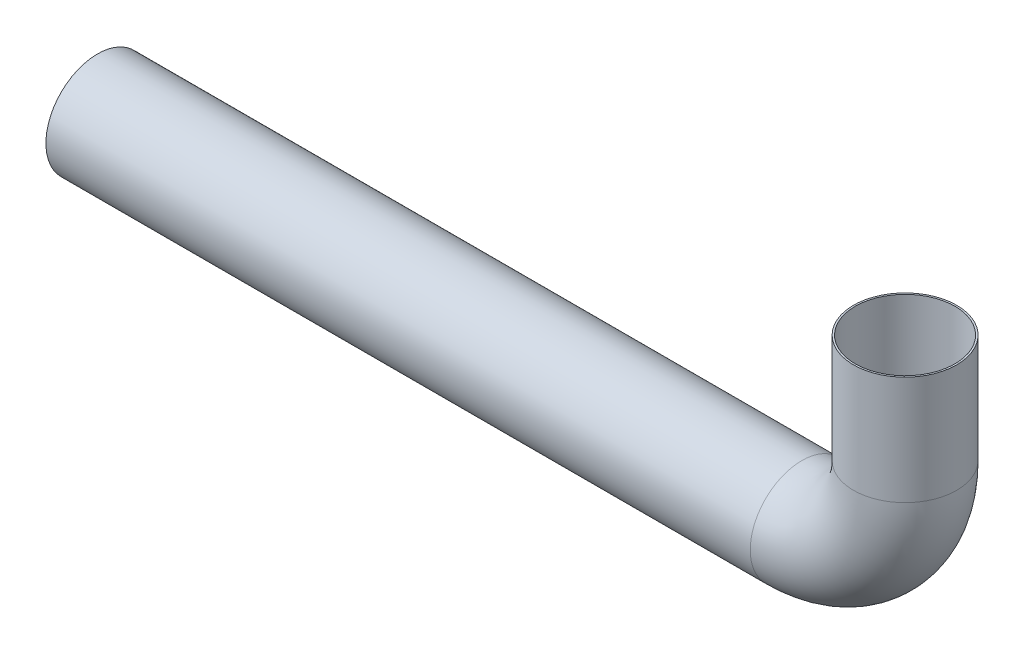
ISO-10303-21;
HEADER;
FILE_DESCRIPTION(('STEP AP214'),'2;1');
FILE_NAME('part.step','',(''),(''),'','','');
FILE_SCHEMA(('AUTOMOTIVE_DESIGN { 1 0 10303 214 1 1 1 1 }'));
ENDSEC;
DATA;
#1=APPLICATION_CONTEXT('core data for automotive mechanical design processes');
#2=APPLICATION_PROTOCOL_DEFINITION('international standard','automotive_design',2000,#1);
#3=PRODUCT_CONTEXT('',#1,'mechanical');
#4=PRODUCT('Part','Part','',(#3));
#5=PRODUCT_RELATED_PRODUCT_CATEGORY('part','',(#4));
#6=PRODUCT_DEFINITION_FORMATION('','',#4);
#7=PRODUCT_DEFINITION_CONTEXT('part definition',#1,'design');
#8=PRODUCT_DEFINITION('design','',#6,#7);
#9=PRODUCT_DEFINITION_SHAPE('','',#8);
#10=(LENGTH_UNIT() NAMED_UNIT(*) SI_UNIT(.MILLI.,.METRE.));
#11=(NAMED_UNIT(*) PLANE_ANGLE_UNIT() SI_UNIT($,.RADIAN.));
#12=(NAMED_UNIT(*) SI_UNIT($,.STERADIAN.) SOLID_ANGLE_UNIT());
#13=UNCERTAINTY_MEASURE_WITH_UNIT(LENGTH_MEASURE(1.E-05),#10,'distance_accuracy_value','');
#14=(GEOMETRIC_REPRESENTATION_CONTEXT(3) GLOBAL_UNCERTAINTY_ASSIGNED_CONTEXT((#13)) GLOBAL_UNIT_ASSIGNED_CONTEXT((#10,
#11,#12)) REPRESENTATION_CONTEXT('',''));
#15=CARTESIAN_POINT('',(0.,0.,0.));
#16=DIRECTION('',(0.,0.,1.));
#17=DIRECTION('',(1.,0.,0.));
#18=AXIS2_PLACEMENT_3D('',#15,#16,#17);
#19=CARTESIAN_POINT('',(-30068.5409075052,-16257.8595632953,40521.7031960563));
#20=DIRECTION('',(1.,0.,0.));
#21=DIRECTION('',(0.,0.,-1.));
#22=AXIS2_PLACEMENT_3D('',#19,#20,#21);
#23=PLANE('',#22);
#24=CARTESIAN_POINT('',(-30068.5409075052,-16257.8595632953,40521.7031960563));
#25=DIRECTION('',(1.,0.,0.));
#26=DIRECTION('',(0.,0.,-1.));
#27=AXIS2_PLACEMENT_3D('',#24,#25,#26);
#28=CIRCLE('',#27,29.0000000000011);
#29=CARTESIAN_POINT('',(-30068.5409075052,-16257.8595632953,40492.7031960563));
#30=VERTEX_POINT('',#29);
#31=EDGE_CURVE('E70',#30,#30,#28,.T.);
#32=ORIENTED_EDGE('',*,*,#31,.T.);
#33=EDGE_LOOP('',(#32));
#34=FACE_BOUND('',#33,.T.);
#35=CARTESIAN_POINT('',(-30068.5409075052,-16257.8595632953,40521.7031960563));
#36=DIRECTION('',(1.,0.,0.));
#37=DIRECTION('',(0.,0.,-1.));
#38=AXIS2_PLACEMENT_3D('',#35,#36,#37);
#39=CIRCLE('',#38,30.0000000000011);
#40=CARTESIAN_POINT('',(-30068.5409075052,-16257.8595632953,40491.7031960563));
#41=VERTEX_POINT('',#40);
#42=EDGE_CURVE('E61',#41,#41,#39,.T.);
#43=ORIENTED_EDGE('',*,*,#42,.F.);
#44=EDGE_LOOP('',(#43));
#45=FACE_BOUND('',#44,.T.);
#46=ADVANCED_FACE('F47',(#34,#45),#23,.F.);
#47=CARTESIAN_POINT('',(-29599.188972505,-16134.6862422111,40521.7031960564));
#48=DIRECTION('',(0.,1.,0.));
#49=DIRECTION('',(0.,0.,-1.));
#50=AXIS2_PLACEMENT_3D('',#47,#48,#49);
#51=PLANE('',#50);
#52=CARTESIAN_POINT('',(-29599.188972505,-16134.6862422111,40521.7031960564));
#53=DIRECTION('',(0.,1.,0.));
#54=DIRECTION('',(-1.,0.,0.));
#55=AXIS2_PLACEMENT_3D('',#52,#53,#54);
#56=CIRCLE('',#55,29.0000000000011);
#57=CARTESIAN_POINT('',(-29628.188972505,-16134.6862422111,40521.7031960564));
#58=VERTEX_POINT('',#57);
#59=EDGE_CURVE('E66',#58,#58,#56,.T.);
#60=ORIENTED_EDGE('',*,*,#59,.F.);
#61=EDGE_LOOP('',(#60));
#62=FACE_BOUND('',#61,.T.);
#63=CARTESIAN_POINT('',(-29599.188972505,-16134.6862422111,40521.7031960564));
#64=DIRECTION('',(0.,1.,0.));
#65=DIRECTION('',(0.,0.,-1.));
#66=AXIS2_PLACEMENT_3D('',#63,#64,#65);
#67=CIRCLE('',#66,30.0000000000011);
#68=CARTESIAN_POINT('',(-29599.188972505,-16134.6862422111,40491.7031960564));
#69=VERTEX_POINT('',#68);
#70=EDGE_CURVE('E11',#69,#69,#67,.T.);
#71=ORIENTED_EDGE('',*,*,#70,.T.);
#72=EDGE_LOOP('',(#71));
#73=FACE_BOUND('',#72,.T.);
#74=ADVANCED_FACE('F106',(#62,#73),#51,.T.);
#75=CARTESIAN_POINT('',(-30068.5409075052,-16257.8595632953,40521.7031960563));
#76=DIRECTION('',(1.,0.,0.));
#77=DIRECTION('',(0.,0.,-1.));
#78=AXIS2_PLACEMENT_3D('',#75,#76,#77);
#79=CYLINDRICAL_SURFACE('',#78,30.0000000000011);
#80=CARTESIAN_POINT('',(-29659.188972505,-16257.8595632953,40521.7031960563));
#81=DIRECTION('',(1.,0.,0.));
#82=DIRECTION('',(0.,0.,-1.));
#83=AXIS2_PLACEMENT_3D('',#80,#81,#82);
#84=CIRCLE('',#83,30.0000000000011);
#85=CARTESIAN_POINT('',(-29659.188972505,-16287.8595632951,40521.7031960554));
#86=VERTEX_POINT('',#85);
#87=EDGE_CURVE('E57',#86,#86,#84,.T.);
#88=ORIENTED_EDGE('',*,*,#87,.F.);
#89=EDGE_LOOP('',(#88));
#90=FACE_BOUND('',#89,.T.);
#91=ORIENTED_EDGE('',*,*,#42,.T.);
#92=EDGE_LOOP('',(#91));
#93=FACE_BOUND('',#92,.T.);
#94=ADVANCED_FACE('F102',(#90,#93),#79,.T.);
#95=CARTESIAN_POINT('',(-29659.188972505,-16197.8595632953,40521.703196058));
#96=DIRECTION('',(0.,0.,1.));
#97=DIRECTION('',(1.,0.,0.));
#98=AXIS2_PLACEMENT_3D('',#95,#96,#97);
#99=TOROIDAL_SURFACE('',#98,59.9999999997394,30.0000000000011);
#100=CARTESIAN_POINT('',(-29599.188972505,-16197.8595632953,40521.7031960564));
#101=DIRECTION('',(0.,1.,0.));
#102=DIRECTION('',(0.,0.,-1.));
#103=AXIS2_PLACEMENT_3D('',#100,#101,#102);
#104=CIRCLE('',#103,30.0000000000011);
#105=CARTESIAN_POINT('',(-29569.1889725052,-16197.8595632953,40521.7031960557));
#106=VERTEX_POINT('',#105);
#107=EDGE_CURVE('E53',#106,#106,#104,.T.);
#108=CARTESIAN_POINT('',(-29659.188972505,-16197.8595632953,40521.703196058));
#109=DIRECTION('',(0.,0.,1.));
#110=DIRECTION('',(1.,0.,0.));
#111=AXIS2_PLACEMENT_3D('',#108,#109,#110);
#112=CIRCLE('',#111,89.9999999997405);
#113=EDGE_CURVE('',#86,#106,#112,.T.);
#114=ORIENTED_EDGE('',*,*,#87,.T.);
#115=ORIENTED_EDGE('',*,*,#107,.F.);
#116=ORIENTED_EDGE('',*,*,#113,.T.);
#117=ORIENTED_EDGE('',*,*,#113,.F.);
#118=EDGE_LOOP('',(#114,#116,#115,#117));
#119=FACE_BOUND('',#118,.T.);
#120=ADVANCED_FACE('F96',(#119),#99,.T.);
#121=CARTESIAN_POINT('',(-29599.188972505,-16197.8595632953,40521.7031960564));
#122=DIRECTION('',(0.,1.,0.));
#123=DIRECTION('',(0.,0.,1.));
#124=AXIS2_PLACEMENT_3D('',#121,#122,#123);
#125=CYLINDRICAL_SURFACE('',#124,30.0000000000011);
#126=ORIENTED_EDGE('',*,*,#70,.F.);
#127=EDGE_LOOP('',(#126));
#128=FACE_BOUND('',#127,.T.);
#129=ORIENTED_EDGE('',*,*,#107,.T.);
#130=EDGE_LOOP('',(#129));
#131=FACE_BOUND('',#130,.T.);
#132=ADVANCED_FACE('F93',(#128,#131),#125,.T.);
#133=CARTESIAN_POINT('',(-30068.5409075052,-16257.8595632953,40521.7031960563));
#134=DIRECTION('',(1.,0.,0.));
#135=DIRECTION('',(0.,0.,-1.));
#136=AXIS2_PLACEMENT_3D('',#133,#134,#135);
#137=CYLINDRICAL_SURFACE('',#136,29.0000000000011);
#138=CARTESIAN_POINT('',(-29659.188972505,-16257.8595632951,40521.703196058));
#139=DIRECTION('',(-1.,0.,0.));
#140=DIRECTION('',(0.,-1.,0.));
#141=AXIS2_PLACEMENT_3D('',#138,#139,#140);
#142=CIRCLE('',#141,29.0000000000011);
#143=CARTESIAN_POINT('',(-29659.188972505,-16286.8595632951,40521.703196058));
#144=VERTEX_POINT('',#143);
#145=EDGE_CURVE('E73',#144,#144,#142,.F.);
#146=ORIENTED_EDGE('',*,*,#145,.T.);
#147=EDGE_LOOP('',(#146));
#148=FACE_BOUND('',#147,.T.);
#149=ORIENTED_EDGE('',*,*,#31,.F.);
#150=EDGE_LOOP('',(#149));
#151=FACE_BOUND('',#150,.T.);
#152=ADVANCED_FACE('F79',(#148,#151),#137,.F.);
#153=CARTESIAN_POINT('',(-29659.188972505,-16197.8595632953,40521.703196058));
#154=DIRECTION('',(0.,0.,1.));
#155=DIRECTION('',(1.,0.,0.));
#156=AXIS2_PLACEMENT_3D('',#153,#154,#155);
#157=TOROIDAL_SURFACE('',#156,59.9999999997394,29.0000000000011);
#158=CARTESIAN_POINT('',(-29599.188972505,-16197.8595632953,40521.7031960564));
#159=DIRECTION('',(0.,1.,0.));
#160=DIRECTION('',(0.,0.,1.));
#161=AXIS2_PLACEMENT_3D('',#158,#159,#160);
#162=CIRCLE('',#161,29.0000000000011);
#163=CARTESIAN_POINT('',(-29570.1889725052,-16197.8595632953,40521.7031960557));
#164=VERTEX_POINT('',#163);
#165=EDGE_CURVE('E69',#164,#164,#162,.T.);
#166=CARTESIAN_POINT('',(-29659.188972505,-16197.8595632953,40521.703196058));
#167=DIRECTION('',(0.,0.,1.));
#168=DIRECTION('',(1.,0.,0.));
#169=AXIS2_PLACEMENT_3D('',#166,#167,#168);
#170=CIRCLE('',#169,88.9999999997405);
#171=EDGE_CURVE('',#144,#164,#170,.T.);
#172=ORIENTED_EDGE('',*,*,#145,.F.);
#173=ORIENTED_EDGE('',*,*,#165,.T.);
#174=ORIENTED_EDGE('',*,*,#171,.T.);
#175=ORIENTED_EDGE('',*,*,#171,.F.);
#176=EDGE_LOOP('',(#172,#174,#173,#175));
#177=FACE_BOUND('',#176,.T.);
#178=ADVANCED_FACE('F82',(#177),#157,.F.);
#179=CARTESIAN_POINT('',(-29599.188972505,-16197.8595632953,40521.7031960564));
#180=DIRECTION('',(0.,1.,0.));
#181=DIRECTION('',(0.,0.,1.));
#182=AXIS2_PLACEMENT_3D('',#179,#180,#181);
#183=CYLINDRICAL_SURFACE('',#182,29.0000000000011);
#184=ORIENTED_EDGE('',*,*,#59,.T.);
#185=EDGE_LOOP('',(#184));
#186=FACE_BOUND('',#185,.T.);
#187=ORIENTED_EDGE('',*,*,#165,.F.);
#188=EDGE_LOOP('',(#187));
#189=FACE_BOUND('',#188,.T.);
#190=ADVANCED_FACE('F84',(#186,#189),#183,.F.);
#191=CLOSED_SHELL('',(#46,#74,#94,#120,#132,#152,#178,#190));
#192=MANIFOLD_SOLID_BREP('B2',#191);
#193=ADVANCED_BREP_SHAPE_REPRESENTATION('',(#18,#192),#14);
#194=SHAPE_DEFINITION_REPRESENTATION(#9,#193);
ENDSEC;
END-ISO-10303-21;
